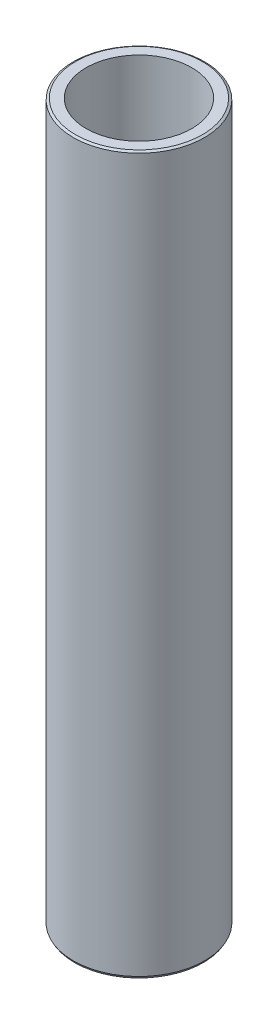
ISO-10303-21;
HEADER;
FILE_DESCRIPTION(('STEP AP214'),'2;1');
FILE_NAME('part.step','',(''),(''),'','','');
FILE_SCHEMA(('AUTOMOTIVE_DESIGN { 1 0 10303 214 1 1 1 1 }'));
ENDSEC;
DATA;
#1=APPLICATION_CONTEXT('core data for automotive mechanical design processes');
#2=APPLICATION_PROTOCOL_DEFINITION('international standard','automotive_design',2000,#1);
#3=PRODUCT_CONTEXT('',#1,'mechanical');
#4=PRODUCT('Part','Part','',(#3));
#5=PRODUCT_RELATED_PRODUCT_CATEGORY('part','',(#4));
#6=PRODUCT_DEFINITION_FORMATION('','',#4);
#7=PRODUCT_DEFINITION_CONTEXT('part definition',#1,'design');
#8=PRODUCT_DEFINITION('design','',#6,#7);
#9=PRODUCT_DEFINITION_SHAPE('','',#8);
#10=(LENGTH_UNIT() NAMED_UNIT(*) SI_UNIT(.MILLI.,.METRE.));
#11=(NAMED_UNIT(*) PLANE_ANGLE_UNIT() SI_UNIT($,.RADIAN.));
#12=(NAMED_UNIT(*) SI_UNIT($,.STERADIAN.) SOLID_ANGLE_UNIT());
#13=UNCERTAINTY_MEASURE_WITH_UNIT(LENGTH_MEASURE(1.E-05),#10,'distance_accuracy_value','');
#14=(GEOMETRIC_REPRESENTATION_CONTEXT(3) GLOBAL_UNCERTAINTY_ASSIGNED_CONTEXT((#13)) GLOBAL_UNIT_ASSIGNED_CONTEXT((#10,
#11,#12)) REPRESENTATION_CONTEXT('',''));
#15=CARTESIAN_POINT('',(0.,0.,0.));
#16=DIRECTION('',(0.,0.,1.));
#17=DIRECTION('',(1.,0.,0.));
#18=AXIS2_PLACEMENT_3D('',#15,#16,#17);
#19=CARTESIAN_POINT('',(0.,600.,0.));
#20=DIRECTION('',(0.,-1.,0.));
#21=DIRECTION('',(0.,0.,-1.));
#22=AXIS2_PLACEMENT_3D('',#19,#20,#21);
#23=CYLINDRICAL_SURFACE('',#22,55.);
#24=CARTESIAN_POINT('',(0.,598.912651335256,0.));
#25=DIRECTION('',(0.,1.,0.));
#26=DIRECTION('',(0.,0.,1.));
#27=AXIS2_PLACEMENT_3D('',#24,#25,#26);
#28=CIRCLE('',#27,55.);
#29=CARTESIAN_POINT('',(0.,598.912651335256,55.));
#30=VERTEX_POINT('',#29);
#31=EDGE_CURVE('E50',#30,#30,#28,.F.);
#32=ORIENTED_EDGE('',*,*,#31,.T.);
#33=EDGE_LOOP('',(#32));
#34=FACE_BOUND('',#33,.T.);
#35=CARTESIAN_POINT('',(0.,1.88334313287986,0.));
#36=DIRECTION('',(0.,1.,0.));
#37=DIRECTION('',(0.,0.,1.));
#38=AXIS2_PLACEMENT_3D('',#35,#36,#37);
#39=CIRCLE('',#38,55.);
#40=CARTESIAN_POINT('',(0.,1.88334313287986,55.));
#41=VERTEX_POINT('',#40);
#42=EDGE_CURVE('E51',#41,#41,#39,.T.);
#43=ORIENTED_EDGE('',*,*,#42,.T.);
#44=EDGE_LOOP('',(#43));
#45=FACE_BOUND('',#44,.T.);
#46=ADVANCED_FACE('F39',(#34,#45),#23,.T.);
#47=CARTESIAN_POINT('',(0.,600.,0.));
#48=DIRECTION('',(0.,1.,0.));
#49=DIRECTION('',(0.,0.,1.));
#50=AXIS2_PLACEMENT_3D('',#47,#48,#49);
#51=PLANE('',#50);
#52=CARTESIAN_POINT('',(0.,600.,0.));
#53=DIRECTION('',(0.,1.,0.));
#54=DIRECTION('',(0.,0.,1.));
#55=AXIS2_PLACEMENT_3D('',#52,#53,#54);
#56=CIRCLE('',#55,53.1166568671205);
#57=CARTESIAN_POINT('',(0.,600.,53.1166568671205));
#58=VERTEX_POINT('',#57);
#59=EDGE_CURVE('E54',#58,#58,#56,.T.);
#60=ORIENTED_EDGE('',*,*,#59,.T.);
#61=EDGE_LOOP('',(#60));
#62=FACE_BOUND('',#61,.T.);
#63=CARTESIAN_POINT('',(0.,600.,0.));
#64=DIRECTION('',(0.,1.,0.));
#65=DIRECTION('',(0.,0.,1.));
#66=AXIS2_PLACEMENT_3D('',#63,#64,#65);
#67=CIRCLE('',#66,44.2520854708023);
#68=CARTESIAN_POINT('',(0.,600.,44.2520854708023));
#69=VERTEX_POINT('',#68);
#70=EDGE_CURVE('E58',#69,#69,#67,.T.);
#71=ORIENTED_EDGE('',*,*,#70,.F.);
#72=EDGE_LOOP('',(#71));
#73=FACE_BOUND('',#72,.T.);
#74=ADVANCED_FACE('F69',(#62,#73),#51,.T.);
#75=CARTESIAN_POINT('',(0.,0.,0.));
#76=DIRECTION('',(0.,1.,0.));
#77=DIRECTION('',(0.,0.,1.));
#78=AXIS2_PLACEMENT_3D('',#75,#76,#77);
#79=PLANE('',#78);
#80=CARTESIAN_POINT('',(0.,0.,0.));
#81=DIRECTION('',(0.,1.,0.));
#82=DIRECTION('',(0.,0.,1.));
#83=AXIS2_PLACEMENT_3D('',#80,#81,#82);
#84=CIRCLE('',#83,53.9126513352554);
#85=CARTESIAN_POINT('',(0.,0.,53.9126513352554));
#86=VERTEX_POINT('',#85);
#87=EDGE_CURVE('E10',#86,#86,#84,.F.);
#88=ORIENTED_EDGE('',*,*,#87,.T.);
#89=EDGE_LOOP('',(#88));
#90=FACE_BOUND('',#89,.T.);
#91=CARTESIAN_POINT('',(0.,0.,0.));
#92=DIRECTION('',(0.,1.,0.));
#93=DIRECTION('',(0.,0.,1.));
#94=AXIS2_PLACEMENT_3D('',#91,#92,#93);
#95=CIRCLE('',#94,44.2520854708023);
#96=CARTESIAN_POINT('',(0.,0.,44.2520854708023));
#97=VERTEX_POINT('',#96);
#98=EDGE_CURVE('E63',#97,#97,#95,.T.);
#99=ORIENTED_EDGE('',*,*,#98,.T.);
#100=EDGE_LOOP('',(#99));
#101=FACE_BOUND('',#100,.T.);
#102=ADVANCED_FACE('F75',(#90,#101),#79,.F.);
#103=CARTESIAN_POINT('',(0.,600.,0.));
#104=DIRECTION('',(0.,-1.,0.));
#105=DIRECTION('',(0.,0.,-1.));
#106=AXIS2_PLACEMENT_3D('',#103,#104,#105);
#107=CYLINDRICAL_SURFACE('',#106,44.2520854708023);
#108=ORIENTED_EDGE('',*,*,#70,.T.);
#109=EDGE_LOOP('',(#108));
#110=FACE_BOUND('',#109,.T.);
#111=ORIENTED_EDGE('',*,*,#98,.F.);
#112=EDGE_LOOP('',(#111));
#113=FACE_BOUND('',#112,.T.);
#114=ADVANCED_FACE('F70',(#110,#113),#107,.F.);
#115=CARTESIAN_POINT('',(0.,600.,0.));
#116=DIRECTION('',(0.,-1.,0.));
#117=DIRECTION('',(0.,0.,-1.));
#118=AXIS2_PLACEMENT_3D('',#115,#116,#117);
#119=CONICAL_SURFACE('',#118,53.1166568671205,1.04719755119661);
#120=ORIENTED_EDGE('',*,*,#31,.F.);
#121=EDGE_LOOP('',(#120));
#122=FACE_BOUND('',#121,.T.);
#123=ORIENTED_EDGE('',*,*,#59,.F.);
#124=EDGE_LOOP('',(#123));
#125=FACE_BOUND('',#124,.T.);
#126=ADVANCED_FACE('F81',(#122,#125),#119,.T.);
#127=CARTESIAN_POINT('',(0.,1.88334313287986,0.));
#128=DIRECTION('',(0.,1.,0.));
#129=DIRECTION('',(0.,0.,1.));
#130=AXIS2_PLACEMENT_3D('',#127,#128,#129);
#131=CONICAL_SURFACE('',#130,55.,0.523598775598309);
#132=ORIENTED_EDGE('',*,*,#87,.F.);
#133=EDGE_LOOP('',(#132));
#134=FACE_BOUND('',#133,.T.);
#135=ORIENTED_EDGE('',*,*,#42,.F.);
#136=EDGE_LOOP('',(#135));
#137=FACE_BOUND('',#136,.T.);
#138=ADVANCED_FACE('F45',(#134,#137),#131,.T.);
#139=CLOSED_SHELL('',(#46,#74,#102,#114,#126,#138));
#140=MANIFOLD_SOLID_BREP('B2',#139);
#141=ADVANCED_BREP_SHAPE_REPRESENTATION('',(#18,#140),#14);
#142=SHAPE_DEFINITION_REPRESENTATION(#9,#141);
ENDSEC;
END-ISO-10303-21;
